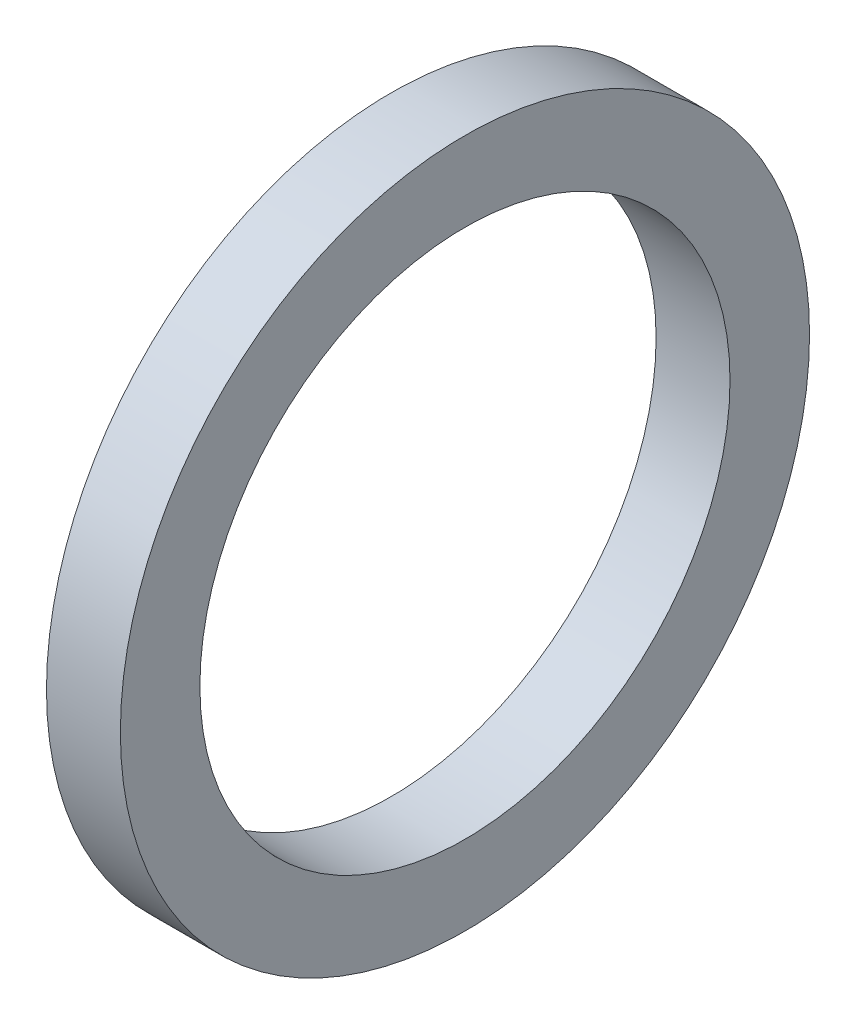
ISO-10303-21;
HEADER;
FILE_DESCRIPTION(('STEP AP214'),'2;1');
FILE_NAME('part.step','',(''),(''),'','','');
FILE_SCHEMA(('AUTOMOTIVE_DESIGN { 1 0 10303 214 1 1 1 1 }'));
ENDSEC;
DATA;
#1=APPLICATION_CONTEXT('core data for automotive mechanical design processes');
#2=APPLICATION_PROTOCOL_DEFINITION('international standard','automotive_design',2000,#1);
#3=PRODUCT_CONTEXT('',#1,'mechanical');
#4=PRODUCT('Part','Part','',(#3));
#5=PRODUCT_RELATED_PRODUCT_CATEGORY('part','',(#4));
#6=PRODUCT_DEFINITION_FORMATION('','',#4);
#7=PRODUCT_DEFINITION_CONTEXT('part definition',#1,'design');
#8=PRODUCT_DEFINITION('design','',#6,#7);
#9=PRODUCT_DEFINITION_SHAPE('','',#8);
#10=(LENGTH_UNIT() NAMED_UNIT(*) SI_UNIT(.MILLI.,.METRE.));
#11=(NAMED_UNIT(*) PLANE_ANGLE_UNIT() SI_UNIT($,.RADIAN.));
#12=(NAMED_UNIT(*) SI_UNIT($,.STERADIAN.) SOLID_ANGLE_UNIT());
#13=UNCERTAINTY_MEASURE_WITH_UNIT(LENGTH_MEASURE(1.E-05),#10,'distance_accuracy_value','');
#14=(GEOMETRIC_REPRESENTATION_CONTEXT(3) GLOBAL_UNCERTAINTY_ASSIGNED_CONTEXT((#13)) GLOBAL_UNIT_ASSIGNED_CONTEXT((#10,
#11,#12)) REPRESENTATION_CONTEXT('',''));
#15=CARTESIAN_POINT('',(0.,0.,0.));
#16=DIRECTION('',(0.,0.,1.));
#17=DIRECTION('',(1.,0.,0.));
#18=AXIS2_PLACEMENT_3D('',#15,#16,#17);
#19=CARTESIAN_POINT('',(27.839800048,25.000000038,0.));
#20=DIRECTION('',(1.,0.,0.));
#21=DIRECTION('',(0.,0.,-1.));
#22=AXIS2_PLACEMENT_3D('',#19,#20,#21);
#23=PLANE('',#22);
#24=CARTESIAN_POINT('',(27.839800048,0.,0.));
#25=DIRECTION('',(-1.,0.,0.));
#26=DIRECTION('',(0.,0.,1.));
#27=AXIS2_PLACEMENT_3D('',#24,#25,#26);
#28=CIRCLE('',#27,25.000000038);
#29=CARTESIAN_POINT('',(27.839800048,0.,25.000000038));
#30=VERTEX_POINT('',#29);
#31=EDGE_CURVE('E49',#30,#30,#28,.T.);
#32=ORIENTED_EDGE('',*,*,#31,.F.);
#33=EDGE_LOOP('',(#32));
#34=FACE_BOUND('',#33,.T.);
#35=CARTESIAN_POINT('',(27.839800048,0.,0.));
#36=DIRECTION('',(-1.,0.,0.));
#37=DIRECTION('',(0.,0.,1.));
#38=AXIS2_PLACEMENT_3D('',#35,#36,#37);
#39=CIRCLE('',#38,32.500000024);
#40=CARTESIAN_POINT('',(27.839800048,0.,32.500000024));
#41=VERTEX_POINT('',#40);
#42=EDGE_CURVE('E10',#41,#41,#39,.T.);
#43=ORIENTED_EDGE('',*,*,#42,.T.);
#44=EDGE_LOOP('',(#43));
#45=FACE_BOUND('',#44,.T.);
#46=ADVANCED_FACE('F35',(#34,#45),#23,.F.);
#47=CARTESIAN_POINT('',(0.,0.,0.));
#48=DIRECTION('',(-1.,0.,0.));
#49=DIRECTION('',(0.,0.,1.));
#50=AXIS2_PLACEMENT_3D('',#47,#48,#49);
#51=CYLINDRICAL_SURFACE('',#50,32.500000024);
#52=ORIENTED_EDGE('',*,*,#42,.F.);
#53=EDGE_LOOP('',(#52));
#54=FACE_BOUND('',#53,.T.);
#55=CARTESIAN_POINT('',(34.809800078,0.,0.));
#56=DIRECTION('',(-1.,0.,0.));
#57=DIRECTION('',(0.,0.,1.));
#58=AXIS2_PLACEMENT_3D('',#55,#56,#57);
#59=CIRCLE('',#58,32.500000024);
#60=CARTESIAN_POINT('',(34.809800078,0.,32.500000024));
#61=VERTEX_POINT('',#60);
#62=EDGE_CURVE('E41',#61,#61,#59,.T.);
#63=ORIENTED_EDGE('',*,*,#62,.T.);
#64=EDGE_LOOP('',(#63));
#65=FACE_BOUND('',#64,.T.);
#66=ADVANCED_FACE('F58',(#54,#65),#51,.T.);
#67=CARTESIAN_POINT('',(34.809800078,25.000000038,0.));
#68=DIRECTION('',(-1.,0.,0.));
#69=DIRECTION('',(0.,0.,1.));
#70=AXIS2_PLACEMENT_3D('',#67,#68,#69);
#71=PLANE('',#70);
#72=ORIENTED_EDGE('',*,*,#62,.F.);
#73=EDGE_LOOP('',(#72));
#74=FACE_BOUND('',#73,.T.);
#75=CARTESIAN_POINT('',(34.809800078,0.,0.));
#76=DIRECTION('',(-1.,0.,0.));
#77=DIRECTION('',(0.,0.,1.));
#78=AXIS2_PLACEMENT_3D('',#75,#76,#77);
#79=CIRCLE('',#78,25.000000038);
#80=CARTESIAN_POINT('',(34.809800078,0.,25.000000038));
#81=VERTEX_POINT('',#80);
#82=EDGE_CURVE('E45',#81,#81,#79,.T.);
#83=ORIENTED_EDGE('',*,*,#82,.T.);
#84=EDGE_LOOP('',(#83));
#85=FACE_BOUND('',#84,.T.);
#86=ADVANCED_FACE('F62',(#74,#85),#71,.F.);
#87=CARTESIAN_POINT('',(0.,0.,0.));
#88=DIRECTION('',(-1.,0.,0.));
#89=DIRECTION('',(0.,0.,1.));
#90=AXIS2_PLACEMENT_3D('',#87,#88,#89);
#91=CYLINDRICAL_SURFACE('',#90,25.000000038);
#92=ORIENTED_EDGE('',*,*,#82,.F.);
#93=EDGE_LOOP('',(#92));
#94=FACE_BOUND('',#93,.T.);
#95=ORIENTED_EDGE('',*,*,#31,.T.);
#96=EDGE_LOOP('',(#95));
#97=FACE_BOUND('',#96,.T.);
#98=ADVANCED_FACE('F55',(#94,#97),#91,.F.);
#99=CLOSED_SHELL('',(#46,#66,#86,#98));
#100=MANIFOLD_SOLID_BREP('B2',#99);
#101=ADVANCED_BREP_SHAPE_REPRESENTATION('',(#18,#100),#14);
#102=SHAPE_DEFINITION_REPRESENTATION(#9,#101);
ENDSEC;
END-ISO-10303-21;
